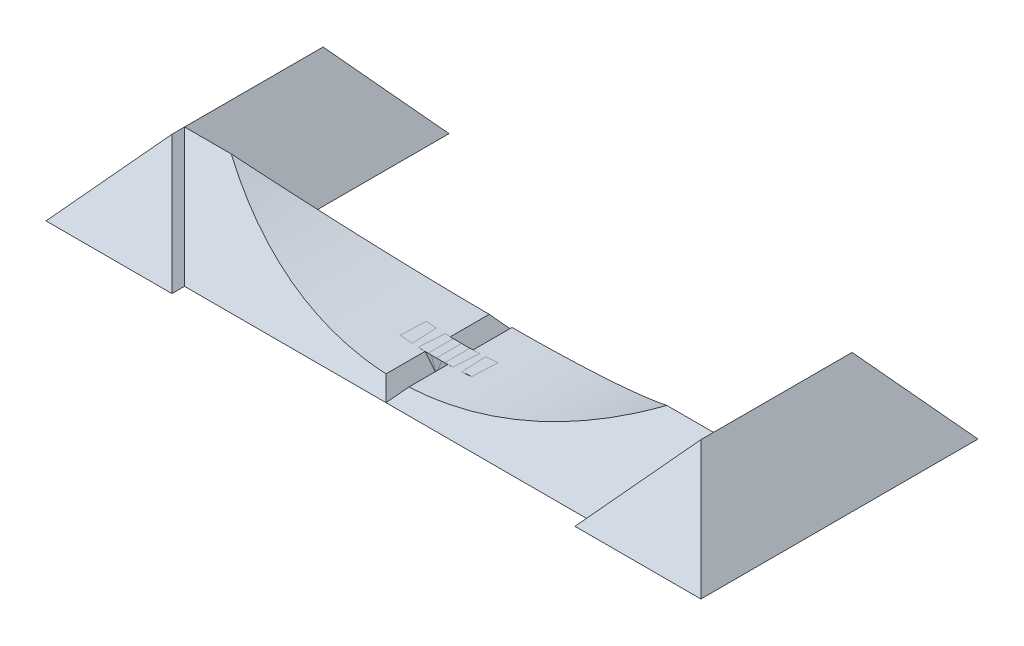
ISO-10303-21;
HEADER;
FILE_DESCRIPTION(('STEP AP214'),'2;1');
FILE_NAME('part.step','',(''),(''),'','','');
FILE_SCHEMA(('AUTOMOTIVE_DESIGN { 1 0 10303 214 1 1 1 1 }'));
ENDSEC;
DATA;
#1=APPLICATION_CONTEXT('core data for automotive mechanical design processes');
#2=APPLICATION_PROTOCOL_DEFINITION('international standard','automotive_design',2000,#1);
#3=PRODUCT_CONTEXT('',#1,'mechanical');
#4=PRODUCT('Part','Part','',(#3));
#5=PRODUCT_RELATED_PRODUCT_CATEGORY('part','',(#4));
#6=PRODUCT_DEFINITION_FORMATION('','',#4);
#7=PRODUCT_DEFINITION_CONTEXT('part definition',#1,'design');
#8=PRODUCT_DEFINITION('design','',#6,#7);
#9=PRODUCT_DEFINITION_SHAPE('','',#8);
#10=(LENGTH_UNIT() NAMED_UNIT(*) SI_UNIT(.MILLI.,.METRE.));
#11=(NAMED_UNIT(*) PLANE_ANGLE_UNIT() SI_UNIT($,.RADIAN.));
#12=(NAMED_UNIT(*) SI_UNIT($,.STERADIAN.) SOLID_ANGLE_UNIT());
#13=UNCERTAINTY_MEASURE_WITH_UNIT(LENGTH_MEASURE(1.E-05),#10,'distance_accuracy_value','');
#14=(GEOMETRIC_REPRESENTATION_CONTEXT(3) GLOBAL_UNCERTAINTY_ASSIGNED_CONTEXT((#13)) GLOBAL_UNIT_ASSIGNED_CONTEXT((#10,
#11,#12)) REPRESENTATION_CONTEXT('',''));
#15=CARTESIAN_POINT('',(0.,0.,0.));
#16=DIRECTION('',(0.,0.,1.));
#17=DIRECTION('',(1.,0.,0.));
#18=AXIS2_PLACEMENT_3D('',#15,#16,#17);
#19=CARTESIAN_POINT('',(0.,0.,0.));
#20=DIRECTION('',(0.766044443118977,0.64278760968654,0.));
#21=DIRECTION('',(0.64278760968654,-0.766044443118977,0.));
#22=AXIS2_PLACEMENT_3D('',#19,#20,#21);
#23=PLANE('',#22);
#24=DIRECTION('',(-0.540716203060937,0.644400477571771,0.540716203060937));
#25=VECTOR('',#24,1.);
#26=CARTESIAN_POINT('',(0.,0.,-50.));
#27=LINE('',#26,#25);
#28=CARTESIAN_POINT('',(-4.52127971956755,5.38825134891795,-45.4787202804325));
#29=VERTEX_POINT('',#28);
#30=CARTESIAN_POINT('',(0.,0.,-50.));
#31=VERTEX_POINT('',#30);
#32=EDGE_CURVE('E176',#29,#31,#27,.F.);
#33=ORIENTED_EDGE('',*,*,#32,.F.);
#34=DIRECTION('',(0.,0.,1.));
#35=VECTOR('',#34,1.);
#36=CARTESIAN_POINT('',(-4.52127971956755,5.38825134891795,-170.5));
#37=LINE('',#36,#35);
#38=CARTESIAN_POINT('',(-4.52127971956755,5.38825134891795,-30.));
#39=VERTEX_POINT('',#38);
#40=EDGE_CURVE('E231',#29,#39,#37,.T.);
#41=ORIENTED_EDGE('',*,*,#40,.T.);
#42=DIRECTION('',(0.64278760968654,-0.766044443118977,0.));
#43=VECTOR('',#42,1.);
#44=CARTESIAN_POINT('',(0.,0.,-30.));
#45=LINE('',#44,#43);
#46=CARTESIAN_POINT('',(0.,0.,-30.));
#47=VERTEX_POINT('',#46);
#48=EDGE_CURVE('E140',#47,#39,#45,.F.);
#49=ORIENTED_EDGE('',*,*,#48,.F.);
#50=DIRECTION('',(0.,0.,1.));
#51=VECTOR('',#50,1.);
#52=CARTESIAN_POINT('',(0.,0.,0.));
#53=LINE('',#52,#51);
#54=EDGE_CURVE('E156',#31,#47,#53,.T.);
#55=ORIENTED_EDGE('',*,*,#54,.F.);
#56=EDGE_LOOP('',(#33,#41,#49,#55));
#57=FACE_BOUND('',#56,.T.);
#58=ADVANCED_FACE('F49',(#57),#23,.T.);
#59=DIRECTION('',(-0.64278760968654,0.766044443118977,0.));
#60=VECTOR('',#59,1.);
#61=CARTESIAN_POINT('',(0.,0.,-20.));
#62=LINE('',#61,#60);
#63=CARTESIAN_POINT('',(-4.52127971956755,5.38825134891795,-20.));
#64=VERTEX_POINT('',#63);
#65=CARTESIAN_POINT('',(0.,0.,-20.));
#66=VERTEX_POINT('',#65);
#67=EDGE_CURVE('E153',#64,#66,#62,.F.);
#68=ORIENTED_EDGE('',*,*,#67,.F.);
#69=CARTESIAN_POINT('',(-4.52127971956755,5.38825134891795,-4.52127971956756));
#70=VERTEX_POINT('',#69);
#71=EDGE_CURVE('E230',#64,#70,#37,.T.);
#72=ORIENTED_EDGE('',*,*,#71,.T.);
#73=DIRECTION('',(0.540716203060937,-0.644400477571771,0.540716203060937));
#74=VECTOR('',#73,1.);
#75=CARTESIAN_POINT('',(0.,0.,0.));
#76=LINE('',#75,#74);
#77=CARTESIAN_POINT('',(0.,0.,0.));
#78=VERTEX_POINT('',#77);
#79=EDGE_CURVE('E177',#70,#78,#76,.T.);
#80=ORIENTED_EDGE('',*,*,#79,.T.);
#81=EDGE_CURVE('E155',#66,#78,#53,.T.);
#82=ORIENTED_EDGE('',*,*,#81,.F.);
#83=EDGE_LOOP('',(#68,#72,#80,#82));
#84=FACE_BOUND('',#83,.T.);
#85=ADVANCED_FACE('F229',(#84),#23,.T.);
#86=CARTESIAN_POINT('',(0.,0.,0.));
#87=DIRECTION('',(0.,0.64278760968654,0.766044443118977));
#88=DIRECTION('',(0.,-0.766044443118977,0.64278760968654));
#89=AXIS2_PLACEMENT_3D('',#86,#87,#88);
#90=PLANE('',#89);
#91=ORIENTED_EDGE('',*,*,#79,.F.);
#92=CARTESIAN_POINT('',(0.,170.326294352033,-142.920730770584));
#93=DIRECTION('',(0.,0.64278760968654,0.766044443118977));
#94=DIRECTION('',(0.,-0.766044443118977,0.64278760968654));
#95=AXIS2_PLACEMENT_3D('',#92,#93,#94);
#96=ELLIPSE('',#95,215.392202739826,165.);
#97=CARTESIAN_POINT('',(-86.4617211357491,29.7938398148552,-25.));
#98=VERTEX_POINT('',#97);
#99=EDGE_CURVE('E216',#70,#98,#96,.F.);
#100=ORIENTED_EDGE('',*,*,#99,.T.);
#101=DIRECTION('',(-1.,0.,0.));
#102=VECTOR('',#101,1.);
#103=CARTESIAN_POINT('',(0.,29.7938398148552,-25.));
#104=LINE('',#103,#102);
#105=CARTESIAN_POINT('',(-105.,29.7938398148552,-25.));
#106=VERTEX_POINT('',#105);
#107=EDGE_CURVE('E57',#106,#98,#104,.F.);
#108=ORIENTED_EDGE('',*,*,#107,.F.);
#109=DIRECTION('',(0.540716203060937,-0.644400477571771,0.540716203060937));
#110=VECTOR('',#109,1.);
#111=CARTESIAN_POINT('',(-56.6100790197891,-27.875022358661,23.389920980211));
#112=LINE('',#111,#110);
#113=CARTESIAN_POINT('',(-80.,0.,0.));
#114=VERTEX_POINT('',#113);
#115=EDGE_CURVE('E180',#106,#114,#112,.T.);
#116=ORIENTED_EDGE('',*,*,#115,.T.);
#117=DIRECTION('',(-1.,0.,0.));
#118=VECTOR('',#117,1.);
#119=CARTESIAN_POINT('',(0.,0.,0.));
#120=LINE('',#119,#118);
#121=EDGE_CURVE('E158',#78,#114,#120,.T.);
#122=ORIENTED_EDGE('',*,*,#121,.F.);
#123=EDGE_LOOP('',(#91,#100,#108,#116,#122));
#124=FACE_BOUND('',#123,.T.);
#125=ADVANCED_FACE('F51',(#124),#90,.T.);
#126=CARTESIAN_POINT('',(-80.,0.,0.));
#127=DIRECTION('',(0.766044443118977,0.64278760968654,0.));
#128=DIRECTION('',(0.64278760968654,-0.766044443118977,0.));
#129=AXIS2_PLACEMENT_3D('',#126,#127,#128);
#130=PLANE('',#129);
#131=DIRECTION('',(0.,0.,-1.));
#132=VECTOR('',#131,1.);
#133=CARTESIAN_POINT('',(-105.,29.7938398148552,0.));
#134=LINE('',#133,#132);
#135=CARTESIAN_POINT('',(-105.,29.7938398148552,-20.));
#136=VERTEX_POINT('',#135);
#137=EDGE_CURVE('E179',#106,#136,#134,.F.);
#138=ORIENTED_EDGE('',*,*,#137,.T.);
#139=DIRECTION('',(0.540716203060937,-0.644400477571771,0.540716203060937));
#140=VECTOR('',#139,1.);
#141=CARTESIAN_POINT('',(-56.6100790197891,-27.875022358661,28.389920980211));
#142=LINE('',#141,#140);
#143=CARTESIAN_POINT('',(-80.,0.,5.));
#144=VERTEX_POINT('',#143);
#145=EDGE_CURVE('E194',#136,#144,#142,.T.);
#146=ORIENTED_EDGE('',*,*,#145,.T.);
#147=DIRECTION('',(0.,0.,1.));
#148=VECTOR('',#147,1.);
#149=CARTESIAN_POINT('',(-80.,0.,0.));
#150=LINE('',#149,#148);
#151=EDGE_CURVE('E161',#114,#144,#150,.T.);
#152=ORIENTED_EDGE('',*,*,#151,.F.);
#153=ORIENTED_EDGE('',*,*,#115,.F.);
#154=EDGE_LOOP('',(#138,#146,#152,#153));
#155=FACE_BOUND('',#154,.T.);
#156=ADVANCED_FACE('F218',(#155),#130,.T.);
#157=CARTESIAN_POINT('',(0.,0.,5.));
#158=DIRECTION('',(0.,0.64278760968654,0.766044443118977));
#159=DIRECTION('',(0.,-0.766044443118977,0.64278760968654));
#160=AXIS2_PLACEMENT_3D('',#157,#158,#159);
#161=PLANE('',#160);
#162=DIRECTION('',(-1.,0.,0.));
#163=VECTOR('',#162,1.);
#164=CARTESIAN_POINT('',(0.,0.,5.));
#165=LINE('',#164,#163);
#166=CARTESIAN_POINT('',(-130.,0.,5.));
#167=VERTEX_POINT('',#166);
#168=EDGE_CURVE('E164',#144,#167,#165,.T.);
#169=ORIENTED_EDGE('',*,*,#168,.F.);
#170=ORIENTED_EDGE('',*,*,#145,.F.);
#171=DIRECTION('',(0.540716203060937,0.644400477571771,-0.540716203060937));
#172=VECTOR('',#171,1.);
#173=CARTESIAN_POINT('',(-91.9913784071572,45.2969113328241,-33.0086215928428));
#174=LINE('',#173,#172);
#175=EDGE_CURVE('E191',#136,#167,#174,.F.);
#176=ORIENTED_EDGE('',*,*,#175,.T.);
#177=EDGE_LOOP('',(#169,#170,#176));
#178=FACE_BOUND('',#177,.T.);
#179=ADVANCED_FACE('F249',(#178),#161,.T.);
#180=CARTESIAN_POINT('',(-130.,0.,0.));
#181=DIRECTION('',(-0.766044443118977,0.64278760968654,0.));
#182=DIRECTION('',(0.64278760968654,0.766044443118977,0.));
#183=AXIS2_PLACEMENT_3D('',#180,#181,#182);
#184=PLANE('',#183);
#185=DIRECTION('',(0.,0.,1.));
#186=VECTOR('',#185,1.);
#187=CARTESIAN_POINT('',(-105.,29.7938398148552,0.));
#188=LINE('',#187,#186);
#189=CARTESIAN_POINT('',(-105.,29.7938398148552,-80.));
#190=VERTEX_POINT('',#189);
#191=EDGE_CURVE('E201',#106,#190,#188,.F.);
#192=ORIENTED_EDGE('',*,*,#191,.T.);
#193=DIRECTION('',(-0.540716203060937,-0.644400477571771,-0.540716203060937));
#194=VECTOR('',#193,1.);
#195=CARTESIAN_POINT('',(-91.9913784071572,45.2969113328241,-66.9913784071572));
#196=LINE('',#195,#194);
#197=CARTESIAN_POINT('',(-130.,0.,-105.));
#198=VERTEX_POINT('',#197);
#199=EDGE_CURVE('E188',#190,#198,#196,.T.);
#200=ORIENTED_EDGE('',*,*,#199,.T.);
#201=DIRECTION('',(0.,0.,1.));
#202=VECTOR('',#201,1.);
#203=CARTESIAN_POINT('',(-130.,0.,0.));
#204=LINE('',#203,#202);
#205=EDGE_CURVE('E167',#198,#167,#204,.T.);
#206=ORIENTED_EDGE('',*,*,#205,.T.);
#207=ORIENTED_EDGE('',*,*,#175,.F.);
#208=ORIENTED_EDGE('',*,*,#137,.F.);
#209=EDGE_LOOP('',(#192,#200,#206,#207,#208));
#210=FACE_BOUND('',#209,.T.);
#211=ADVANCED_FACE('F247',(#210),#184,.T.);
#212=CARTESIAN_POINT('',(0.,0.,-105.));
#213=DIRECTION('',(0.,0.64278760968654,-0.766044443118977));
#214=DIRECTION('',(0.,0.766044443118977,0.64278760968654));
#215=AXIS2_PLACEMENT_3D('',#212,#213,#214);
#216=PLANE('',#215);
#217=DIRECTION('',(-1.,0.,0.));
#218=VECTOR('',#217,1.);
#219=CARTESIAN_POINT('',(0.,0.,-105.));
#220=LINE('',#219,#218);
#221=CARTESIAN_POINT('',(-80.,0.,-105.));
#222=VERTEX_POINT('',#221);
#223=EDGE_CURVE('E169',#222,#198,#220,.T.);
#224=ORIENTED_EDGE('',*,*,#223,.T.);
#225=ORIENTED_EDGE('',*,*,#199,.F.);
#226=DIRECTION('',(-0.540716203060937,0.644400477571771,0.540716203060937));
#227=VECTOR('',#226,1.);
#228=CARTESIAN_POINT('',(-56.610079019789,-27.875022358661,-128.389920980211));
#229=LINE('',#228,#227);
#230=EDGE_CURVE('E185',#190,#222,#229,.F.);
#231=ORIENTED_EDGE('',*,*,#230,.T.);
#232=EDGE_LOOP('',(#224,#225,#231));
#233=FACE_BOUND('',#232,.T.);
#234=ADVANCED_FACE('F251',(#233),#216,.T.);
#235=CARTESIAN_POINT('',(-80.,0.,0.));
#236=DIRECTION('',(0.766044443118977,0.64278760968654,0.));
#237=DIRECTION('',(0.64278760968654,-0.766044443118977,0.));
#238=AXIS2_PLACEMENT_3D('',#235,#236,#237);
#239=PLANE('',#238);
#240=DIRECTION('',(-0.540716203060937,0.644400477571771,0.540716203060937));
#241=VECTOR('',#240,1.);
#242=CARTESIAN_POINT('',(-56.610079019789,-27.875022358661,-73.3899209802109));
#243=LINE('',#242,#241);
#244=CARTESIAN_POINT('',(-80.,0.,-50.));
#245=VERTEX_POINT('',#244);
#246=EDGE_CURVE('E182',#106,#245,#243,.F.);
#247=ORIENTED_EDGE('',*,*,#246,.T.);
#248=DIRECTION('',(0.,0.,1.));
#249=VECTOR('',#248,1.);
#250=CARTESIAN_POINT('',(-80.,0.,0.));
#251=LINE('',#250,#249);
#252=EDGE_CURVE('E171',#222,#245,#251,.T.);
#253=ORIENTED_EDGE('',*,*,#252,.F.);
#254=ORIENTED_EDGE('',*,*,#230,.F.);
#255=ORIENTED_EDGE('',*,*,#191,.F.);
#256=EDGE_LOOP('',(#247,#253,#254,#255));
#257=FACE_BOUND('',#256,.T.);
#258=ADVANCED_FACE('F244',(#257),#239,.T.);
#259=CARTESIAN_POINT('',(0.,0.,-50.));
#260=DIRECTION('',(0.,0.64278760968654,-0.766044443118977));
#261=DIRECTION('',(0.,0.766044443118977,0.64278760968654));
#262=AXIS2_PLACEMENT_3D('',#259,#260,#261);
#263=PLANE('',#262);
#264=CARTESIAN_POINT('',(0.,170.326294352033,92.9207307705841));
#265=DIRECTION('',(0.,0.64278760968654,-0.766044443118977));
#266=DIRECTION('',(0.,0.766044443118977,0.64278760968654));
#267=AXIS2_PLACEMENT_3D('',#264,#265,#266);
#268=ELLIPSE('',#267,215.392202739826,165.);
#269=EDGE_CURVE('E208',#29,#98,#268,.T.);
#270=ORIENTED_EDGE('',*,*,#269,.F.);
#271=ORIENTED_EDGE('',*,*,#32,.T.);
#272=DIRECTION('',(-1.,0.,0.));
#273=VECTOR('',#272,1.);
#274=CARTESIAN_POINT('',(0.,0.,-50.));
#275=LINE('',#274,#273);
#276=EDGE_CURVE('E174',#31,#245,#275,.T.);
#277=ORIENTED_EDGE('',*,*,#276,.T.);
#278=ORIENTED_EDGE('',*,*,#246,.F.);
#279=ORIENTED_EDGE('',*,*,#107,.T.);
#280=EDGE_LOOP('',(#270,#271,#277,#278,#279));
#281=FACE_BOUND('',#280,.T.);
#282=ADVANCED_FACE('F207',(#281),#263,.T.);
#283=CARTESIAN_POINT('',(0.,0.,0.));
#284=DIRECTION('',(0.,1.,0.));
#285=DIRECTION('',(0.,0.,1.));
#286=AXIS2_PLACEMENT_3D('',#283,#284,#285);
#287=PLANE('',#286);
#288=ORIENTED_EDGE('',*,*,#81,.T.);
#289=ORIENTED_EDGE('',*,*,#121,.T.);
#290=ORIENTED_EDGE('',*,*,#151,.T.);
#291=ORIENTED_EDGE('',*,*,#168,.T.);
#292=ORIENTED_EDGE('',*,*,#205,.F.);
#293=ORIENTED_EDGE('',*,*,#223,.F.);
#294=ORIENTED_EDGE('',*,*,#252,.T.);
#295=ORIENTED_EDGE('',*,*,#276,.F.);
#296=ORIENTED_EDGE('',*,*,#54,.T.);
#297=DIRECTION('',(-1.,0.,0.));
#298=VECTOR('',#297,1.);
#299=CARTESIAN_POINT('',(15.2283347225379,0.,-30.));
#300=LINE('',#299,#298);
#301=CARTESIAN_POINT('',(15.2283347225379,0.,-30.));
#302=VERTEX_POINT('',#301);
#303=EDGE_CURVE('E71',#302,#47,#300,.T.);
#304=ORIENTED_EDGE('',*,*,#303,.F.);
#305=DIRECTION('',(0.,0.,-1.));
#306=VECTOR('',#305,1.);
#307=CARTESIAN_POINT('',(15.2283347225379,0.,-20.));
#308=LINE('',#307,#306);
#309=CARTESIAN_POINT('',(15.2283347225379,0.,-20.));
#310=VERTEX_POINT('',#309);
#311=EDGE_CURVE('E144',#310,#302,#308,.T.);
#312=ORIENTED_EDGE('',*,*,#311,.F.);
#313=DIRECTION('',(1.,0.,0.));
#314=VECTOR('',#313,1.);
#315=CARTESIAN_POINT('',(15.2283347225379,0.,-20.));
#316=LINE('',#315,#314);
#317=EDGE_CURVE('E146',#66,#310,#316,.T.);
#318=ORIENTED_EDGE('',*,*,#317,.F.);
#319=EDGE_LOOP('',(#288,#289,#290,#291,#292,#293,#294,#295,#296,#304,#312,#318));
#320=FACE_BOUND('',#319,.T.);
#321=ADVANCED_FACE('F223',(#320),#287,.F.);
#322=CARTESIAN_POINT('',(15.2283347225379,7.,-20.));
#323=DIRECTION('',(0.,0.,1.));
#324=DIRECTION('',(-1.,0.,0.));
#325=AXIS2_PLACEMENT_3D('',#322,#323,#324);
#326=PLANE('',#325);
#327=CARTESIAN_POINT('',(0.,170.326294352033,-20.));
#328=DIRECTION('',(0.,0.,1.));
#329=DIRECTION('',(1.,0.,0.));
#330=AXIS2_PLACEMENT_3D('',#327,#328,#329);
#331=CIRCLE('',#330,165.);
#332=CARTESIAN_POINT('',(15.2283347225379,6.03053110301205,-20.));
#333=VERTEX_POINT('',#332);
#334=EDGE_CURVE('E63',#64,#333,#331,.T.);
#335=ORIENTED_EDGE('',*,*,#334,.F.);
#336=ORIENTED_EDGE('',*,*,#67,.T.);
#337=ORIENTED_EDGE('',*,*,#317,.T.);
#338=DIRECTION('',(0.,-1.,0.));
#339=VECTOR('',#338,1.);
#340=CARTESIAN_POINT('',(15.2283347225379,7.,-20.));
#341=LINE('',#340,#339);
#342=EDGE_CURVE('E145',#333,#310,#341,.T.);
#343=ORIENTED_EDGE('',*,*,#342,.F.);
#344=EDGE_LOOP('',(#335,#336,#337,#343));
#345=FACE_BOUND('',#344,.T.);
#346=ADVANCED_FACE('F272',(#345),#326,.T.);
#347=CARTESIAN_POINT('',(15.2283347225379,7.,-30.));
#348=DIRECTION('',(0.,0.,-1.));
#349=DIRECTION('',(1.,0.,0.));
#350=AXIS2_PLACEMENT_3D('',#347,#348,#349);
#351=PLANE('',#350);
#352=CARTESIAN_POINT('',(0.,170.326294352033,-30.));
#353=DIRECTION('',(0.,0.,-1.));
#354=DIRECTION('',(-1.,0.,0.));
#355=AXIS2_PLACEMENT_3D('',#352,#353,#354);
#356=CIRCLE('',#355,165.);
#357=CARTESIAN_POINT('',(15.2283347225379,6.03053110301205,-30.));
#358=VERTEX_POINT('',#357);
#359=EDGE_CURVE('E131',#358,#39,#356,.T.);
#360=ORIENTED_EDGE('',*,*,#359,.F.);
#361=DIRECTION('',(0.,-1.,0.));
#362=VECTOR('',#361,1.);
#363=CARTESIAN_POINT('',(15.2283347225379,7.,-30.));
#364=LINE('',#363,#362);
#365=EDGE_CURVE('E137',#358,#302,#364,.T.);
#366=ORIENTED_EDGE('',*,*,#365,.T.);
#367=ORIENTED_EDGE('',*,*,#303,.T.);
#368=ORIENTED_EDGE('',*,*,#48,.T.);
#369=EDGE_LOOP('',(#360,#366,#367,#368));
#370=FACE_BOUND('',#369,.T.);
#371=ADVANCED_FACE('F136',(#370),#351,.T.);
#372=CARTESIAN_POINT('',(15.2283347225379,7.,-20.));
#373=DIRECTION('',(1.,0.,0.));
#374=DIRECTION('',(0.,0.,1.));
#375=AXIS2_PLACEMENT_3D('',#372,#373,#374);
#376=PLANE('',#375);
#377=DIRECTION('',(0.,0.,1.));
#378=VECTOR('',#377,1.);
#379=CARTESIAN_POINT('',(15.2283347225379,6.03053110301205,-170.5));
#380=LINE('',#379,#378);
#381=EDGE_CURVE('E12',#333,#358,#380,.F.);
#382=ORIENTED_EDGE('',*,*,#381,.F.);
#383=ORIENTED_EDGE('',*,*,#342,.T.);
#384=ORIENTED_EDGE('',*,*,#311,.T.);
#385=ORIENTED_EDGE('',*,*,#365,.F.);
#386=EDGE_LOOP('',(#382,#383,#384,#385));
#387=FACE_BOUND('',#386,.T.);
#388=ADVANCED_FACE('F142',(#387),#376,.T.);
#389=CARTESIAN_POINT('',(0.,170.326294352033,-170.5));
#390=DIRECTION('',(0.,0.,1.));
#391=DIRECTION('',(1.,0.,0.));
#392=AXIS2_PLACEMENT_3D('',#389,#390,#391);
#393=CYLINDRICAL_SURFACE('',#392,165.);
#394=ORIENTED_EDGE('',*,*,#71,.F.);
#395=ORIENTED_EDGE('',*,*,#334,.T.);
#396=ORIENTED_EDGE('',*,*,#381,.T.);
#397=ORIENTED_EDGE('',*,*,#359,.T.);
#398=ORIENTED_EDGE('',*,*,#40,.F.);
#399=ORIENTED_EDGE('',*,*,#269,.T.);
#400=ORIENTED_EDGE('',*,*,#99,.F.);
#401=EDGE_LOOP('',(#394,#395,#396,#397,#398,#399,#400));
#402=FACE_BOUND('',#401,.T.);
#403=ADVANCED_FACE('F130',(#402),#393,.F.);
#404=CLOSED_SHELL('',(#58,#85,#125,#156,#179,#211,#234,#258,#282,#321,#346,#371,#388,#403));
#405=MANIFOLD_SOLID_BREP('B2',#404);
#406=CARTESIAN_POINT('',(0.,0.,0.));
#407=DIRECTION('',(-0.766044443118977,0.64278760968654,0.));
#408=DIRECTION('',(-0.64278760968654,-0.766044443118977,0.));
#409=AXIS2_PLACEMENT_3D('',#406,#407,#408);
#410=PLANE('',#409);
#411=DIRECTION('',(-0.540716203060937,-0.644400477571771,0.540716203060937));
#412=VECTOR('',#411,1.);
#413=CARTESIAN_POINT('',(0.,0.,0.));
#414=LINE('',#413,#412);
#415=CARTESIAN_POINT('',(4.52127971956755,5.38825134891795,-4.52127971956756));
#416=VERTEX_POINT('',#415);
#417=CARTESIAN_POINT('',(0.,0.,0.));
#418=VERTEX_POINT('',#417);
#419=EDGE_CURVE('E508',#416,#418,#414,.T.);
#420=ORIENTED_EDGE('',*,*,#419,.F.);
#421=DIRECTION('',(0.,0.,1.));
#422=VECTOR('',#421,1.);
#423=CARTESIAN_POINT('',(4.52127971956755,5.38825134891795,-170.5));
#424=LINE('',#423,#422);
#425=CARTESIAN_POINT('',(4.52127971956755,5.38825134891795,-20.));
#426=VERTEX_POINT('',#425);
#427=EDGE_CURVE('E560',#416,#426,#424,.F.);
#428=ORIENTED_EDGE('',*,*,#427,.T.);
#429=DIRECTION('',(0.64278760968654,0.766044443118977,0.));
#430=VECTOR('',#429,1.);
#431=CARTESIAN_POINT('',(0.,0.,-20.));
#432=LINE('',#431,#430);
#433=CARTESIAN_POINT('',(0.,0.,-20.));
#434=VERTEX_POINT('',#433);
#435=EDGE_CURVE('E467',#426,#434,#432,.F.);
#436=ORIENTED_EDGE('',*,*,#435,.T.);
#437=DIRECTION('',(0.,0.,1.));
#438=VECTOR('',#437,1.);
#439=CARTESIAN_POINT('',(0.,0.,0.));
#440=LINE('',#439,#438);
#441=EDGE_CURVE('E484',#434,#418,#440,.T.);
#442=ORIENTED_EDGE('',*,*,#441,.T.);
#443=EDGE_LOOP('',(#420,#428,#436,#442));
#444=FACE_BOUND('',#443,.T.);
#445=ADVANCED_FACE('F374',(#444),#410,.T.);
#446=DIRECTION('',(-0.64278760968654,-0.766044443118977,0.));
#447=VECTOR('',#446,1.);
#448=CARTESIAN_POINT('',(0.,0.,-30.));
#449=LINE('',#448,#447);
#450=CARTESIAN_POINT('',(0.,0.,-30.));
#451=VERTEX_POINT('',#450);
#452=CARTESIAN_POINT('',(4.52127971956755,5.38825134891795,-30.));
#453=VERTEX_POINT('',#452);
#454=EDGE_CURVE('E474',#451,#453,#449,.F.);
#455=ORIENTED_EDGE('',*,*,#454,.T.);
#456=CARTESIAN_POINT('',(4.52127971956755,5.38825134891795,-45.4787202804325));
#457=VERTEX_POINT('',#456);
#458=EDGE_CURVE('E468',#453,#457,#424,.F.);
#459=ORIENTED_EDGE('',*,*,#458,.T.);
#460=DIRECTION('',(0.540716203060937,0.644400477571771,0.540716203060937));
#461=VECTOR('',#460,1.);
#462=CARTESIAN_POINT('',(0.,0.,-50.));
#463=LINE('',#462,#461);
#464=CARTESIAN_POINT('',(0.,0.,-50.));
#465=VERTEX_POINT('',#464);
#466=EDGE_CURVE('E507',#457,#465,#463,.F.);
#467=ORIENTED_EDGE('',*,*,#466,.T.);
#468=EDGE_CURVE('E396',#465,#451,#440,.T.);
#469=ORIENTED_EDGE('',*,*,#468,.T.);
#470=EDGE_LOOP('',(#455,#459,#467,#469));
#471=FACE_BOUND('',#470,.T.);
#472=ADVANCED_FACE('F559',(#471),#410,.T.);
#473=CARTESIAN_POINT('',(0.,0.,0.));
#474=DIRECTION('',(0.,0.64278760968654,0.766044443118977));
#475=DIRECTION('',(0.,-0.766044443118977,0.64278760968654));
#476=AXIS2_PLACEMENT_3D('',#473,#474,#475);
#477=PLANE('',#476);
#478=DIRECTION('',(1.,0.,0.));
#479=VECTOR('',#478,1.);
#480=CARTESIAN_POINT('',(0.,29.7938398148552,-25.));
#481=LINE('',#480,#479);
#482=CARTESIAN_POINT('',(105.,29.7938398148552,-25.));
#483=VERTEX_POINT('',#482);
#484=CARTESIAN_POINT('',(86.4617211357491,29.7938398148552,-25.));
#485=VERTEX_POINT('',#484);
#486=EDGE_CURVE('E382',#483,#485,#481,.F.);
#487=ORIENTED_EDGE('',*,*,#486,.T.);
#488=CARTESIAN_POINT('',(0.,170.326294352033,-142.920730770584));
#489=DIRECTION('',(0.,0.64278760968654,0.766044443118977));
#490=DIRECTION('',(0.,-0.766044443118977,0.64278760968654));
#491=AXIS2_PLACEMENT_3D('',#488,#489,#490);
#492=ELLIPSE('',#491,215.392202739826,165.);
#493=EDGE_CURVE('E531',#485,#416,#492,.F.);
#494=ORIENTED_EDGE('',*,*,#493,.T.);
#495=ORIENTED_EDGE('',*,*,#419,.T.);
#496=DIRECTION('',(1.,0.,0.));
#497=VECTOR('',#496,1.);
#498=CARTESIAN_POINT('',(0.,0.,0.));
#499=LINE('',#498,#497);
#500=CARTESIAN_POINT('',(80.,0.,0.));
#501=VERTEX_POINT('',#500);
#502=EDGE_CURVE('E486',#418,#501,#499,.T.);
#503=ORIENTED_EDGE('',*,*,#502,.T.);
#504=DIRECTION('',(-0.540716203060937,-0.644400477571771,0.540716203060937));
#505=VECTOR('',#504,1.);
#506=CARTESIAN_POINT('',(56.6100790197891,-27.875022358661,23.389920980211));
#507=LINE('',#506,#505);
#508=EDGE_CURVE('E511',#483,#501,#507,.T.);
#509=ORIENTED_EDGE('',*,*,#508,.F.);
#510=EDGE_LOOP('',(#487,#494,#495,#503,#509));
#511=FACE_BOUND('',#510,.T.);
#512=ADVANCED_FACE('F376',(#511),#477,.T.);
#513=CARTESIAN_POINT('',(80.,0.,0.));
#514=DIRECTION('',(-0.766044443118977,0.64278760968654,0.));
#515=DIRECTION('',(-0.64278760968654,-0.766044443118977,0.));
#516=AXIS2_PLACEMENT_3D('',#513,#514,#515);
#517=PLANE('',#516);
#518=DIRECTION('',(0.,0.,-1.));
#519=VECTOR('',#518,1.);
#520=CARTESIAN_POINT('',(105.,29.7938398148552,0.));
#521=LINE('',#520,#519);
#522=CARTESIAN_POINT('',(105.,29.7938398148552,-20.));
#523=VERTEX_POINT('',#522);
#524=EDGE_CURVE('E510',#483,#523,#521,.F.);
#525=ORIENTED_EDGE('',*,*,#524,.F.);
#526=ORIENTED_EDGE('',*,*,#508,.T.);
#527=DIRECTION('',(0.,0.,1.));
#528=VECTOR('',#527,1.);
#529=CARTESIAN_POINT('',(80.,0.,0.));
#530=LINE('',#529,#528);
#531=CARTESIAN_POINT('',(80.,0.,5.));
#532=VERTEX_POINT('',#531);
#533=EDGE_CURVE('E489',#501,#532,#530,.T.);
#534=ORIENTED_EDGE('',*,*,#533,.T.);
#535=DIRECTION('',(-0.540716203060937,-0.644400477571771,0.540716203060937));
#536=VECTOR('',#535,1.);
#537=CARTESIAN_POINT('',(56.6100790197891,-27.875022358661,28.389920980211));
#538=LINE('',#537,#536);
#539=EDGE_CURVE('E521',#523,#532,#538,.T.);
#540=ORIENTED_EDGE('',*,*,#539,.F.);
#541=EDGE_LOOP('',(#525,#526,#534,#540));
#542=FACE_BOUND('',#541,.T.);
#543=ADVANCED_FACE('F543',(#542),#517,.T.);
#544=CARTESIAN_POINT('',(0.,0.,5.));
#545=DIRECTION('',(0.,0.64278760968654,0.766044443118977));
#546=DIRECTION('',(0.,-0.766044443118977,0.64278760968654));
#547=AXIS2_PLACEMENT_3D('',#544,#545,#546);
#548=PLANE('',#547);
#549=DIRECTION('',(1.,0.,0.));
#550=VECTOR('',#549,1.);
#551=CARTESIAN_POINT('',(0.,0.,5.));
#552=LINE('',#551,#550);
#553=CARTESIAN_POINT('',(130.,0.,5.));
#554=VERTEX_POINT('',#553);
#555=EDGE_CURVE('E492',#532,#554,#552,.T.);
#556=ORIENTED_EDGE('',*,*,#555,.T.);
#557=DIRECTION('',(-0.540716203060937,0.644400477571771,-0.540716203060937));
#558=VECTOR('',#557,1.);
#559=CARTESIAN_POINT('',(91.9913784071572,45.2969113328241,-33.0086215928428));
#560=LINE('',#559,#558);
#561=EDGE_CURVE('E519',#523,#554,#560,.F.);
#562=ORIENTED_EDGE('',*,*,#561,.F.);
#563=ORIENTED_EDGE('',*,*,#539,.T.);
#564=EDGE_LOOP('',(#556,#562,#563));
#565=FACE_BOUND('',#564,.T.);
#566=ADVANCED_FACE('F574',(#565),#548,.T.);
#567=CARTESIAN_POINT('',(130.,0.,0.));
#568=DIRECTION('',(0.766044443118977,0.64278760968654,0.));
#569=DIRECTION('',(-0.64278760968654,0.766044443118977,0.));
#570=AXIS2_PLACEMENT_3D('',#567,#568,#569);
#571=PLANE('',#570);
#572=DIRECTION('',(0.,0.,1.));
#573=VECTOR('',#572,1.);
#574=CARTESIAN_POINT('',(105.,29.7938398148552,0.));
#575=LINE('',#574,#573);
#576=CARTESIAN_POINT('',(105.,29.7938398148552,-80.));
#577=VERTEX_POINT('',#576);
#578=EDGE_CURVE('E525',#483,#577,#575,.F.);
#579=ORIENTED_EDGE('',*,*,#578,.F.);
#580=ORIENTED_EDGE('',*,*,#524,.T.);
#581=ORIENTED_EDGE('',*,*,#561,.T.);
#582=DIRECTION('',(0.,0.,1.));
#583=VECTOR('',#582,1.);
#584=CARTESIAN_POINT('',(130.,0.,0.));
#585=LINE('',#584,#583);
#586=CARTESIAN_POINT('',(130.,0.,-105.));
#587=VERTEX_POINT('',#586);
#588=EDGE_CURVE('E495',#587,#554,#585,.T.);
#589=ORIENTED_EDGE('',*,*,#588,.F.);
#590=DIRECTION('',(0.540716203060937,-0.644400477571771,-0.540716203060937));
#591=VECTOR('',#590,1.);
#592=CARTESIAN_POINT('',(91.9913784071572,45.2969113328241,-66.9913784071572));
#593=LINE('',#592,#591);
#594=EDGE_CURVE('E517',#577,#587,#593,.T.);
#595=ORIENTED_EDGE('',*,*,#594,.F.);
#596=EDGE_LOOP('',(#579,#580,#581,#589,#595));
#597=FACE_BOUND('',#596,.T.);
#598=ADVANCED_FACE('F546',(#597),#571,.T.);
#599=CARTESIAN_POINT('',(0.,0.,-105.));
#600=DIRECTION('',(0.,0.64278760968654,-0.766044443118977));
#601=DIRECTION('',(0.,0.766044443118977,0.64278760968654));
#602=AXIS2_PLACEMENT_3D('',#599,#600,#601);
#603=PLANE('',#602);
#604=DIRECTION('',(1.,0.,0.));
#605=VECTOR('',#604,1.);
#606=CARTESIAN_POINT('',(0.,0.,-105.));
#607=LINE('',#606,#605);
#608=CARTESIAN_POINT('',(80.,0.,-105.));
#609=VERTEX_POINT('',#608);
#610=EDGE_CURVE('E498',#609,#587,#607,.T.);
#611=ORIENTED_EDGE('',*,*,#610,.F.);
#612=DIRECTION('',(0.540716203060937,0.644400477571771,0.540716203060937));
#613=VECTOR('',#612,1.);
#614=CARTESIAN_POINT('',(56.610079019789,-27.875022358661,-128.389920980211));
#615=LINE('',#614,#613);
#616=EDGE_CURVE('E515',#577,#609,#615,.F.);
#617=ORIENTED_EDGE('',*,*,#616,.F.);
#618=ORIENTED_EDGE('',*,*,#594,.T.);
#619=EDGE_LOOP('',(#611,#617,#618));
#620=FACE_BOUND('',#619,.T.);
#621=ADVANCED_FACE('F581',(#620),#603,.T.);
#622=CARTESIAN_POINT('',(80.,0.,0.));
#623=DIRECTION('',(-0.766044443118977,0.64278760968654,0.));
#624=DIRECTION('',(-0.64278760968654,-0.766044443118977,0.));
#625=AXIS2_PLACEMENT_3D('',#622,#623,#624);
#626=PLANE('',#625);
#627=DIRECTION('',(0.540716203060937,0.644400477571771,0.540716203060937));
#628=VECTOR('',#627,1.);
#629=CARTESIAN_POINT('',(56.610079019789,-27.875022358661,-73.3899209802109));
#630=LINE('',#629,#628);
#631=CARTESIAN_POINT('',(80.,0.,-50.));
#632=VERTEX_POINT('',#631);
#633=EDGE_CURVE('E513',#483,#632,#630,.F.);
#634=ORIENTED_EDGE('',*,*,#633,.F.);
#635=ORIENTED_EDGE('',*,*,#578,.T.);
#636=ORIENTED_EDGE('',*,*,#616,.T.);
#637=DIRECTION('',(0.,0.,1.));
#638=VECTOR('',#637,1.);
#639=CARTESIAN_POINT('',(80.,0.,0.));
#640=LINE('',#639,#638);
#641=EDGE_CURVE('E501',#609,#632,#640,.T.);
#642=ORIENTED_EDGE('',*,*,#641,.T.);
#643=EDGE_LOOP('',(#634,#635,#636,#642));
#644=FACE_BOUND('',#643,.T.);
#645=ADVANCED_FACE('F551',(#644),#626,.T.);
#646=CARTESIAN_POINT('',(0.,0.,-50.));
#647=DIRECTION('',(0.,0.64278760968654,-0.766044443118977));
#648=DIRECTION('',(0.,0.766044443118977,0.64278760968654));
#649=AXIS2_PLACEMENT_3D('',#646,#647,#648);
#650=PLANE('',#649);
#651=CARTESIAN_POINT('',(0.,170.326294352033,92.9207307705841));
#652=DIRECTION('',(0.,0.64278760968654,-0.766044443118977));
#653=DIRECTION('',(0.,0.766044443118977,0.64278760968654));
#654=AXIS2_PLACEMENT_3D('',#651,#652,#653);
#655=ELLIPSE('',#654,215.392202739826,165.);
#656=EDGE_CURVE('E540',#485,#457,#655,.T.);
#657=ORIENTED_EDGE('',*,*,#656,.F.);
#658=ORIENTED_EDGE('',*,*,#486,.F.);
#659=ORIENTED_EDGE('',*,*,#633,.T.);
#660=DIRECTION('',(1.,0.,0.));
#661=VECTOR('',#660,1.);
#662=CARTESIAN_POINT('',(0.,0.,-50.));
#663=LINE('',#662,#661);
#664=EDGE_CURVE('E504',#465,#632,#663,.T.);
#665=ORIENTED_EDGE('',*,*,#664,.F.);
#666=ORIENTED_EDGE('',*,*,#466,.F.);
#667=EDGE_LOOP('',(#657,#658,#659,#665,#666));
#668=FACE_BOUND('',#667,.T.);
#669=ADVANCED_FACE('F537',(#668),#650,.T.);
#670=CARTESIAN_POINT('',(0.,0.,0.));
#671=DIRECTION('',(0.,1.,0.));
#672=DIRECTION('',(0.,0.,1.));
#673=AXIS2_PLACEMENT_3D('',#670,#671,#672);
#674=PLANE('',#673);
#675=ORIENTED_EDGE('',*,*,#441,.F.);
#676=DIRECTION('',(-1.,0.,0.));
#677=VECTOR('',#676,1.);
#678=CARTESIAN_POINT('',(-15.2283347225379,0.,-20.));
#679=LINE('',#678,#677);
#680=CARTESIAN_POINT('',(-15.2283347225379,0.,-20.));
#681=VERTEX_POINT('',#680);
#682=EDGE_CURVE('E478',#434,#681,#679,.T.);
#683=ORIENTED_EDGE('',*,*,#682,.T.);
#684=DIRECTION('',(0.,0.,-1.));
#685=VECTOR('',#684,1.);
#686=CARTESIAN_POINT('',(-15.2283347225379,0.,-20.));
#687=LINE('',#686,#685);
#688=CARTESIAN_POINT('',(-15.2283347225379,0.,-30.));
#689=VERTEX_POINT('',#688);
#690=EDGE_CURVE('E473',#681,#689,#687,.T.);
#691=ORIENTED_EDGE('',*,*,#690,.T.);
#692=DIRECTION('',(1.,0.,0.));
#693=VECTOR('',#692,1.);
#694=CARTESIAN_POINT('',(-15.2283347225379,0.,-30.));
#695=LINE('',#694,#693);
#696=EDGE_CURVE('E566',#689,#451,#695,.T.);
#697=ORIENTED_EDGE('',*,*,#696,.T.);
#698=ORIENTED_EDGE('',*,*,#468,.F.);
#699=ORIENTED_EDGE('',*,*,#664,.T.);
#700=ORIENTED_EDGE('',*,*,#641,.F.);
#701=ORIENTED_EDGE('',*,*,#610,.T.);
#702=ORIENTED_EDGE('',*,*,#588,.T.);
#703=ORIENTED_EDGE('',*,*,#555,.F.);
#704=ORIENTED_EDGE('',*,*,#533,.F.);
#705=ORIENTED_EDGE('',*,*,#502,.F.);
#706=EDGE_LOOP('',(#675,#683,#691,#697,#698,#699,#700,#701,#702,#703,#704,#705));
#707=FACE_BOUND('',#706,.T.);
#708=ADVANCED_FACE('F556',(#707),#674,.F.);
#709=CARTESIAN_POINT('',(-15.2283347225379,7.,-20.));
#710=DIRECTION('',(0.,0.,1.));
#711=DIRECTION('',(1.,0.,0.));
#712=AXIS2_PLACEMENT_3D('',#709,#710,#711);
#713=PLANE('',#712);
#714=CARTESIAN_POINT('',(0.,170.326294352033,-20.));
#715=DIRECTION('',(0.,0.,1.));
#716=DIRECTION('',(1.,0.,0.));
#717=AXIS2_PLACEMENT_3D('',#714,#715,#716);
#718=CIRCLE('',#717,165.);
#719=CARTESIAN_POINT('',(-15.2283347225379,6.03053110301205,-20.));
#720=VERTEX_POINT('',#719);
#721=EDGE_CURVE('E456',#720,#426,#718,.T.);
#722=ORIENTED_EDGE('',*,*,#721,.F.);
#723=DIRECTION('',(0.,-1.,0.));
#724=VECTOR('',#723,1.);
#725=CARTESIAN_POINT('',(-15.2283347225379,7.,-20.));
#726=LINE('',#725,#724);
#727=EDGE_CURVE('E465',#720,#681,#726,.T.);
#728=ORIENTED_EDGE('',*,*,#727,.T.);
#729=ORIENTED_EDGE('',*,*,#682,.F.);
#730=ORIENTED_EDGE('',*,*,#435,.F.);
#731=EDGE_LOOP('',(#722,#728,#729,#730));
#732=FACE_BOUND('',#731,.T.);
#733=ADVANCED_FACE('F463',(#732),#713,.T.);
#734=CARTESIAN_POINT('',(-15.2283347225379,7.,-30.));
#735=DIRECTION('',(0.,0.,-1.));
#736=DIRECTION('',(-1.,0.,0.));
#737=AXIS2_PLACEMENT_3D('',#734,#735,#736);
#738=PLANE('',#737);
#739=CARTESIAN_POINT('',(0.,170.326294352033,-30.));
#740=DIRECTION('',(0.,0.,-1.));
#741=DIRECTION('',(-1.,0.,0.));
#742=AXIS2_PLACEMENT_3D('',#739,#740,#741);
#743=CIRCLE('',#742,165.);
#744=CARTESIAN_POINT('',(-15.2283347225379,6.03053110301205,-30.));
#745=VERTEX_POINT('',#744);
#746=EDGE_CURVE('E388',#453,#745,#743,.T.);
#747=ORIENTED_EDGE('',*,*,#746,.F.);
#748=ORIENTED_EDGE('',*,*,#454,.F.);
#749=ORIENTED_EDGE('',*,*,#696,.F.);
#750=DIRECTION('',(0.,-1.,0.));
#751=VECTOR('',#750,1.);
#752=CARTESIAN_POINT('',(-15.2283347225379,7.,-30.));
#753=LINE('',#752,#751);
#754=EDGE_CURVE('E475',#745,#689,#753,.T.);
#755=ORIENTED_EDGE('',*,*,#754,.F.);
#756=EDGE_LOOP('',(#747,#748,#749,#755));
#757=FACE_BOUND('',#756,.T.);
#758=ADVANCED_FACE('F621',(#757),#738,.T.);
#759=CARTESIAN_POINT('',(-15.2283347225379,7.,-20.));
#760=DIRECTION('',(-1.,0.,0.));
#761=DIRECTION('',(0.,0.,1.));
#762=AXIS2_PLACEMENT_3D('',#759,#760,#761);
#763=PLANE('',#762);
#764=DIRECTION('',(0.,0.,1.));
#765=VECTOR('',#764,1.);
#766=CARTESIAN_POINT('',(-15.2283347225379,6.03053110301205,-170.5));
#767=LINE('',#766,#765);
#768=EDGE_CURVE('E47',#745,#720,#767,.T.);
#769=ORIENTED_EDGE('',*,*,#768,.F.);
#770=ORIENTED_EDGE('',*,*,#754,.T.);
#771=ORIENTED_EDGE('',*,*,#690,.F.);
#772=ORIENTED_EDGE('',*,*,#727,.F.);
#773=EDGE_LOOP('',(#769,#770,#771,#772));
#774=FACE_BOUND('',#773,.T.);
#775=ADVANCED_FACE('F471',(#774),#763,.T.);
#776=CARTESIAN_POINT('',(0.,170.326294352033,-170.5));
#777=DIRECTION('',(0.,0.,1.));
#778=DIRECTION('',(1.,0.,0.));
#779=AXIS2_PLACEMENT_3D('',#776,#777,#778);
#780=CYLINDRICAL_SURFACE('',#779,165.);
#781=ORIENTED_EDGE('',*,*,#656,.T.);
#782=ORIENTED_EDGE('',*,*,#458,.F.);
#783=ORIENTED_EDGE('',*,*,#746,.T.);
#784=ORIENTED_EDGE('',*,*,#768,.T.);
#785=ORIENTED_EDGE('',*,*,#721,.T.);
#786=ORIENTED_EDGE('',*,*,#427,.F.);
#787=ORIENTED_EDGE('',*,*,#493,.F.);
#788=EDGE_LOOP('',(#781,#782,#783,#784,#785,#786,#787));
#789=FACE_BOUND('',#788,.T.);
#790=ADVANCED_FACE('F455',(#789),#780,.F.);
#791=CLOSED_SHELL('',(#445,#472,#512,#543,#566,#598,#621,#645,#669,#708,#733,#758,#775,#790));
#792=MANIFOLD_SOLID_BREP('B6',#791);
#793=ADVANCED_BREP_SHAPE_REPRESENTATION('',(#18,#405,#792),#14);
#794=SHAPE_DEFINITION_REPRESENTATION(#9,#793);
ENDSEC;
END-ISO-10303-21;
